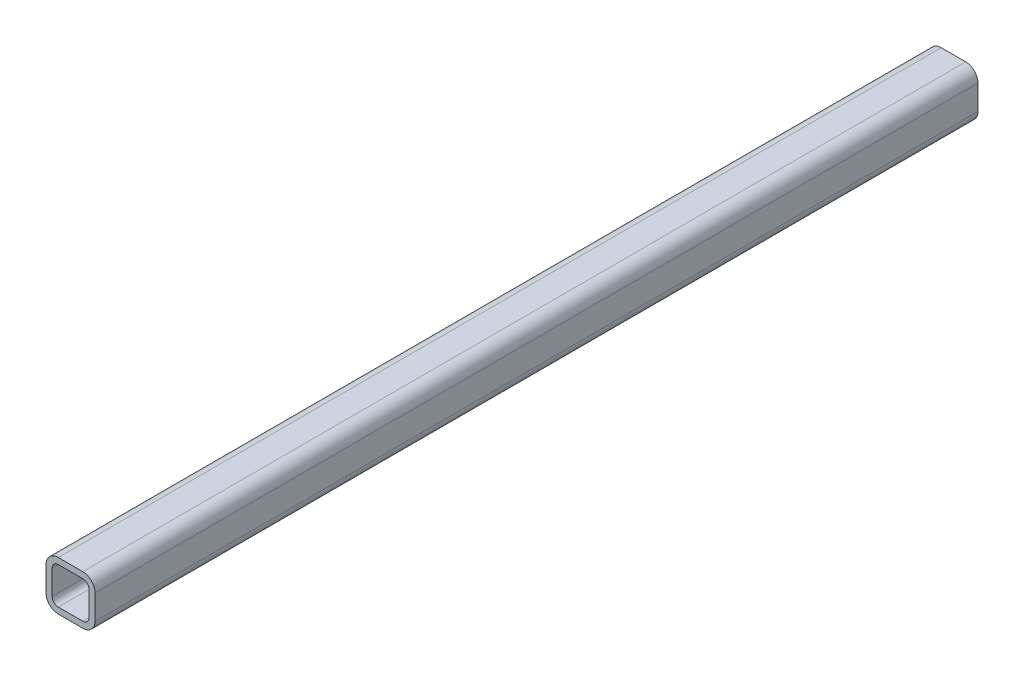
ISO-10303-21;
HEADER;
FILE_DESCRIPTION(('STEP AP214'),'2;1');
FILE_NAME('part.step','',(''),(''),'','','');
FILE_SCHEMA(('AUTOMOTIVE_DESIGN { 1 0 10303 214 1 1 1 1 }'));
ENDSEC;
DATA;
#1=APPLICATION_CONTEXT('core data for automotive mechanical design processes');
#2=APPLICATION_PROTOCOL_DEFINITION('international standard','automotive_design',2000,#1);
#3=PRODUCT_CONTEXT('',#1,'mechanical');
#4=PRODUCT('Part','Part','',(#3));
#5=PRODUCT_RELATED_PRODUCT_CATEGORY('part','',(#4));
#6=PRODUCT_DEFINITION_FORMATION('','',#4);
#7=PRODUCT_DEFINITION_CONTEXT('part definition',#1,'design');
#8=PRODUCT_DEFINITION('design','',#6,#7);
#9=PRODUCT_DEFINITION_SHAPE('','',#8);
#10=(LENGTH_UNIT() NAMED_UNIT(*) SI_UNIT(.MILLI.,.METRE.));
#11=(NAMED_UNIT(*) PLANE_ANGLE_UNIT() SI_UNIT($,.RADIAN.));
#12=(NAMED_UNIT(*) SI_UNIT($,.STERADIAN.) SOLID_ANGLE_UNIT());
#13=UNCERTAINTY_MEASURE_WITH_UNIT(LENGTH_MEASURE(1.E-05),#10,'distance_accuracy_value','');
#14=(GEOMETRIC_REPRESENTATION_CONTEXT(3) GLOBAL_UNCERTAINTY_ASSIGNED_CONTEXT((#13)) GLOBAL_UNIT_ASSIGNED_CONTEXT((#10,
#11,#12)) REPRESENTATION_CONTEXT('',''));
#15=CARTESIAN_POINT('',(0.,0.,0.));
#16=DIRECTION('',(0.,0.,1.));
#17=DIRECTION('',(1.,0.,0.));
#18=AXIS2_PLACEMENT_3D('',#15,#16,#17);
#19=CARTESIAN_POINT('',(38.1,38.1,457.2));
#20=DIRECTION('',(0.,0.,1.));
#21=DIRECTION('',(1.,0.,0.));
#22=AXIS2_PLACEMENT_3D('',#19,#20,#21);
#23=PLANE('',#22);
#24=CARTESIAN_POINT('',(38.1,38.1,457.2));
#25=DIRECTION('',(0.,0.,1.));
#26=DIRECTION('',(1.,0.,0.));
#27=AXIS2_PLACEMENT_3D('',#24,#25,#26);
#28=CIRCLE('',#27,12.7);
#29=CARTESIAN_POINT('',(50.8,38.1,457.2));
#30=VERTEX_POINT('',#29);
#31=CARTESIAN_POINT('',(38.1,50.8,457.2));
#32=VERTEX_POINT('',#31);
#33=EDGE_CURVE('E213',#30,#32,#28,.T.);
#34=ORIENTED_EDGE('',*,*,#33,.T.);
#35=DIRECTION('',(-1.,0.,0.));
#36=VECTOR('',#35,1.);
#37=CARTESIAN_POINT('',(38.1,50.8,457.2));
#38=LINE('',#37,#36);
#39=CARTESIAN_POINT('',(12.7,50.8,457.2));
#40=VERTEX_POINT('',#39);
#41=EDGE_CURVE('E216',#32,#40,#38,.T.);
#42=ORIENTED_EDGE('',*,*,#41,.T.);
#43=CARTESIAN_POINT('',(12.7,38.1,457.2));
#44=DIRECTION('',(0.,0.,1.));
#45=DIRECTION('',(1.,0.,0.));
#46=AXIS2_PLACEMENT_3D('',#43,#44,#45);
#47=CIRCLE('',#46,12.7);
#48=CARTESIAN_POINT('',(0.,38.1,457.2));
#49=VERTEX_POINT('',#48);
#50=EDGE_CURVE('E219',#40,#49,#47,.T.);
#51=ORIENTED_EDGE('',*,*,#50,.T.);
#52=DIRECTION('',(0.,-1.,0.));
#53=VECTOR('',#52,1.);
#54=CARTESIAN_POINT('',(0.,12.7,457.2));
#55=LINE('',#54,#53);
#56=CARTESIAN_POINT('',(0.,12.7,457.2));
#57=VERTEX_POINT('',#56);
#58=EDGE_CURVE('E221',#49,#57,#55,.T.);
#59=ORIENTED_EDGE('',*,*,#58,.T.);
#60=CARTESIAN_POINT('',(12.7,12.7,457.2));
#61=DIRECTION('',(0.,0.,1.));
#62=DIRECTION('',(1.,0.,0.));
#63=AXIS2_PLACEMENT_3D('',#60,#61,#62);
#64=CIRCLE('',#63,12.7);
#65=CARTESIAN_POINT('',(12.7,0.,457.2));
#66=VERTEX_POINT('',#65);
#67=EDGE_CURVE('E223',#57,#66,#64,.T.);
#68=ORIENTED_EDGE('',*,*,#67,.T.);
#69=DIRECTION('',(1.,0.,0.));
#70=VECTOR('',#69,1.);
#71=CARTESIAN_POINT('',(12.7,0.,457.2));
#72=LINE('',#71,#70);
#73=CARTESIAN_POINT('',(38.1,0.,457.2));
#74=VERTEX_POINT('',#73);
#75=EDGE_CURVE('E225',#66,#74,#72,.T.);
#76=ORIENTED_EDGE('',*,*,#75,.T.);
#77=CARTESIAN_POINT('',(38.1,12.7,457.2));
#78=DIRECTION('',(0.,0.,1.));
#79=DIRECTION('',(1.,0.,0.));
#80=AXIS2_PLACEMENT_3D('',#77,#78,#79);
#81=CIRCLE('',#80,12.7);
#82=CARTESIAN_POINT('',(50.8,12.7,457.2));
#83=VERTEX_POINT('',#82);
#84=EDGE_CURVE('E227',#74,#83,#81,.T.);
#85=ORIENTED_EDGE('',*,*,#84,.T.);
#86=DIRECTION('',(0.,1.,0.));
#87=VECTOR('',#86,1.);
#88=CARTESIAN_POINT('',(50.8,38.1,457.2));
#89=LINE('',#88,#87);
#90=EDGE_CURVE('E229',#83,#30,#89,.T.);
#91=ORIENTED_EDGE('',*,*,#90,.T.);
#92=EDGE_LOOP('',(#34,#42,#51,#59,#68,#76,#85,#91));
#93=FACE_BOUND('',#92,.T.);
#94=DIRECTION('',(0.,-1.,0.));
#95=VECTOR('',#94,1.);
#96=CARTESIAN_POINT('',(6.35,12.7,457.2));
#97=LINE('',#96,#95);
#98=CARTESIAN_POINT('',(6.35,38.1,457.2));
#99=VERTEX_POINT('',#98);
#100=CARTESIAN_POINT('',(6.35,12.7,457.2));
#101=VERTEX_POINT('',#100);
#102=EDGE_CURVE('E156',#99,#101,#97,.T.);
#103=ORIENTED_EDGE('',*,*,#102,.F.);
#104=CARTESIAN_POINT('',(12.7,38.1,457.2));
#105=DIRECTION('',(0.,0.,1.));
#106=DIRECTION('',(1.,0.,0.));
#107=AXIS2_PLACEMENT_3D('',#104,#105,#106);
#108=CIRCLE('',#107,6.35);
#109=CARTESIAN_POINT('',(12.7,44.45,457.2));
#110=VERTEX_POINT('',#109);
#111=EDGE_CURVE('E148',#110,#99,#108,.T.);
#112=ORIENTED_EDGE('',*,*,#111,.F.);
#113=DIRECTION('',(-1.,0.,0.));
#114=VECTOR('',#113,1.);
#115=CARTESIAN_POINT('',(38.1,44.45,457.2));
#116=LINE('',#115,#114);
#117=CARTESIAN_POINT('',(38.1,44.45,457.2));
#118=VERTEX_POINT('',#117);
#119=EDGE_CURVE('E181',#118,#110,#116,.T.);
#120=ORIENTED_EDGE('',*,*,#119,.F.);
#121=CARTESIAN_POINT('',(38.1,38.1,457.2));
#122=DIRECTION('',(0.,0.,1.));
#123=DIRECTION('',(1.,0.,0.));
#124=AXIS2_PLACEMENT_3D('',#121,#122,#123);
#125=CIRCLE('',#124,6.35);
#126=CARTESIAN_POINT('',(44.45,38.1,457.2));
#127=VERTEX_POINT('',#126);
#128=EDGE_CURVE('E179',#127,#118,#125,.T.);
#129=ORIENTED_EDGE('',*,*,#128,.F.);
#130=DIRECTION('',(0.,1.,0.));
#131=VECTOR('',#130,1.);
#132=CARTESIAN_POINT('',(44.45,38.1,457.2));
#133=LINE('',#132,#131);
#134=CARTESIAN_POINT('',(44.45,12.7,457.2));
#135=VERTEX_POINT('',#134);
#136=EDGE_CURVE('E177',#135,#127,#133,.T.);
#137=ORIENTED_EDGE('',*,*,#136,.F.);
#138=CARTESIAN_POINT('',(38.1,12.7,457.2));
#139=DIRECTION('',(0.,0.,1.));
#140=DIRECTION('',(1.,0.,0.));
#141=AXIS2_PLACEMENT_3D('',#138,#139,#140);
#142=CIRCLE('',#141,6.35);
#143=CARTESIAN_POINT('',(38.1,6.35,457.2));
#144=VERTEX_POINT('',#143);
#145=EDGE_CURVE('E175',#144,#135,#142,.T.);
#146=ORIENTED_EDGE('',*,*,#145,.F.);
#147=DIRECTION('',(1.,0.,0.));
#148=VECTOR('',#147,1.);
#149=CARTESIAN_POINT('',(12.7,6.34999999999999,457.2));
#150=LINE('',#149,#148);
#151=CARTESIAN_POINT('',(12.7,6.34999999999999,457.2));
#152=VERTEX_POINT('',#151);
#153=EDGE_CURVE('E171',#152,#144,#150,.T.);
#154=ORIENTED_EDGE('',*,*,#153,.F.);
#155=CARTESIAN_POINT('',(12.7,12.7,457.2));
#156=DIRECTION('',(0.,0.,1.));
#157=DIRECTION('',(1.,0.,0.));
#158=AXIS2_PLACEMENT_3D('',#155,#156,#157);
#159=CIRCLE('',#158,6.35);
#160=EDGE_CURVE('E169',#101,#152,#159,.T.);
#161=ORIENTED_EDGE('',*,*,#160,.F.);
#162=EDGE_LOOP('',(#103,#112,#120,#129,#137,#146,#154,#161));
#163=FACE_BOUND('',#162,.T.);
#164=ADVANCED_FACE('F35',(#93,#163),#23,.T.);
#165=CARTESIAN_POINT('',(38.1,38.1,-457.2));
#166=DIRECTION('',(0.,0.,1.));
#167=DIRECTION('',(1.,0.,0.));
#168=AXIS2_PLACEMENT_3D('',#165,#166,#167);
#169=PLANE('',#168);
#170=CARTESIAN_POINT('',(38.1,38.1,-457.2));
#171=DIRECTION('',(0.,0.,1.));
#172=DIRECTION('',(1.,0.,0.));
#173=AXIS2_PLACEMENT_3D('',#170,#171,#172);
#174=CIRCLE('',#173,12.7);
#175=CARTESIAN_POINT('',(50.8,38.1,-457.2));
#176=VERTEX_POINT('',#175);
#177=CARTESIAN_POINT('',(38.1,50.8,-457.2));
#178=VERTEX_POINT('',#177);
#179=EDGE_CURVE('E164',#176,#178,#174,.T.);
#180=ORIENTED_EDGE('',*,*,#179,.F.);
#181=DIRECTION('',(0.,1.,0.));
#182=VECTOR('',#181,1.);
#183=CARTESIAN_POINT('',(50.8,38.1,-457.2));
#184=LINE('',#183,#182);
#185=CARTESIAN_POINT('',(50.8,12.7,-457.2));
#186=VERTEX_POINT('',#185);
#187=EDGE_CURVE('E217',#186,#176,#184,.T.);
#188=ORIENTED_EDGE('',*,*,#187,.F.);
#189=CARTESIAN_POINT('',(38.1,12.7,-457.2));
#190=DIRECTION('',(0.,0.,1.));
#191=DIRECTION('',(1.,0.,0.));
#192=AXIS2_PLACEMENT_3D('',#189,#190,#191);
#193=CIRCLE('',#192,12.7);
#194=CARTESIAN_POINT('',(38.1,0.,-457.2));
#195=VERTEX_POINT('',#194);
#196=EDGE_CURVE('E244',#195,#186,#193,.T.);
#197=ORIENTED_EDGE('',*,*,#196,.F.);
#198=DIRECTION('',(1.,0.,0.));
#199=VECTOR('',#198,1.);
#200=CARTESIAN_POINT('',(12.7,0.,-457.2));
#201=LINE('',#200,#199);
#202=CARTESIAN_POINT('',(12.7,0.,-457.2));
#203=VERTEX_POINT('',#202);
#204=EDGE_CURVE('E242',#203,#195,#201,.T.);
#205=ORIENTED_EDGE('',*,*,#204,.F.);
#206=CARTESIAN_POINT('',(12.7,12.7,-457.2));
#207=DIRECTION('',(0.,0.,1.));
#208=DIRECTION('',(1.,0.,0.));
#209=AXIS2_PLACEMENT_3D('',#206,#207,#208);
#210=CIRCLE('',#209,12.7);
#211=CARTESIAN_POINT('',(0.,12.7,-457.2));
#212=VERTEX_POINT('',#211);
#213=EDGE_CURVE('E240',#212,#203,#210,.T.);
#214=ORIENTED_EDGE('',*,*,#213,.F.);
#215=DIRECTION('',(0.,-1.,0.));
#216=VECTOR('',#215,1.);
#217=CARTESIAN_POINT('',(0.,12.7,-457.2));
#218=LINE('',#217,#216);
#219=CARTESIAN_POINT('',(0.,38.1,-457.2));
#220=VERTEX_POINT('',#219);
#221=EDGE_CURVE('E238',#220,#212,#218,.T.);
#222=ORIENTED_EDGE('',*,*,#221,.F.);
#223=CARTESIAN_POINT('',(12.7,38.1,-457.2));
#224=DIRECTION('',(0.,0.,1.));
#225=DIRECTION('',(1.,0.,0.));
#226=AXIS2_PLACEMENT_3D('',#223,#224,#225);
#227=CIRCLE('',#226,12.7);
#228=CARTESIAN_POINT('',(12.7,50.8,-457.2));
#229=VERTEX_POINT('',#228);
#230=EDGE_CURVE('E236',#229,#220,#227,.T.);
#231=ORIENTED_EDGE('',*,*,#230,.F.);
#232=DIRECTION('',(-1.,0.,0.));
#233=VECTOR('',#232,1.);
#234=CARTESIAN_POINT('',(38.1,50.8,-457.2));
#235=LINE('',#234,#233);
#236=EDGE_CURVE('E234',#178,#229,#235,.T.);
#237=ORIENTED_EDGE('',*,*,#236,.F.);
#238=EDGE_LOOP('',(#180,#188,#197,#205,#214,#222,#231,#237));
#239=FACE_BOUND('',#238,.T.);
#240=CARTESIAN_POINT('',(12.7,38.1,-457.2));
#241=DIRECTION('',(0.,0.,1.));
#242=DIRECTION('',(1.,0.,0.));
#243=AXIS2_PLACEMENT_3D('',#240,#241,#242);
#244=CIRCLE('',#243,6.35);
#245=CARTESIAN_POINT('',(12.7,44.45,-457.2));
#246=VERTEX_POINT('',#245);
#247=CARTESIAN_POINT('',(6.35,38.1,-457.2));
#248=VERTEX_POINT('',#247);
#249=EDGE_CURVE('E58',#246,#248,#244,.T.);
#250=ORIENTED_EDGE('',*,*,#249,.T.);
#251=DIRECTION('',(0.,-1.,0.));
#252=VECTOR('',#251,1.);
#253=CARTESIAN_POINT('',(6.35,12.7,-457.2));
#254=LINE('',#253,#252);
#255=CARTESIAN_POINT('',(6.35,12.7,-457.2));
#256=VERTEX_POINT('',#255);
#257=EDGE_CURVE('E163',#248,#256,#254,.T.);
#258=ORIENTED_EDGE('',*,*,#257,.T.);
#259=CARTESIAN_POINT('',(12.7,12.7,-457.2));
#260=DIRECTION('',(0.,0.,1.));
#261=DIRECTION('',(1.,0.,0.));
#262=AXIS2_PLACEMENT_3D('',#259,#260,#261);
#263=CIRCLE('',#262,6.35);
#264=CARTESIAN_POINT('',(12.7,6.34999999999999,-457.2));
#265=VERTEX_POINT('',#264);
#266=EDGE_CURVE('E185',#256,#265,#263,.T.);
#267=ORIENTED_EDGE('',*,*,#266,.T.);
#268=DIRECTION('',(1.,0.,0.));
#269=VECTOR('',#268,1.);
#270=CARTESIAN_POINT('',(12.7,6.34999999999999,-457.2));
#271=LINE('',#270,#269);
#272=CARTESIAN_POINT('',(38.1,6.35,-457.2));
#273=VERTEX_POINT('',#272);
#274=EDGE_CURVE('E188',#265,#273,#271,.T.);
#275=ORIENTED_EDGE('',*,*,#274,.T.);
#276=CARTESIAN_POINT('',(38.1,12.7,-457.2));
#277=DIRECTION('',(0.,0.,1.));
#278=DIRECTION('',(1.,0.,0.));
#279=AXIS2_PLACEMENT_3D('',#276,#277,#278);
#280=CIRCLE('',#279,6.35);
#281=CARTESIAN_POINT('',(44.45,12.7,-457.2));
#282=VERTEX_POINT('',#281);
#283=EDGE_CURVE('E191',#273,#282,#280,.T.);
#284=ORIENTED_EDGE('',*,*,#283,.T.);
#285=DIRECTION('',(0.,1.,0.));
#286=VECTOR('',#285,1.);
#287=CARTESIAN_POINT('',(44.45,38.1,-457.2));
#288=LINE('',#287,#286);
#289=CARTESIAN_POINT('',(44.45,38.1,-457.2));
#290=VERTEX_POINT('',#289);
#291=EDGE_CURVE('E194',#282,#290,#288,.T.);
#292=ORIENTED_EDGE('',*,*,#291,.T.);
#293=CARTESIAN_POINT('',(38.1,38.1,-457.2));
#294=DIRECTION('',(0.,0.,1.));
#295=DIRECTION('',(1.,0.,0.));
#296=AXIS2_PLACEMENT_3D('',#293,#294,#295);
#297=CIRCLE('',#296,6.35);
#298=CARTESIAN_POINT('',(38.1,44.45,-457.2));
#299=VERTEX_POINT('',#298);
#300=EDGE_CURVE('E197',#290,#299,#297,.T.);
#301=ORIENTED_EDGE('',*,*,#300,.T.);
#302=DIRECTION('',(-1.,0.,0.));
#303=VECTOR('',#302,1.);
#304=CARTESIAN_POINT('',(38.1,44.45,-457.2));
#305=LINE('',#304,#303);
#306=EDGE_CURVE('E157',#299,#246,#305,.T.);
#307=ORIENTED_EDGE('',*,*,#306,.T.);
#308=EDGE_LOOP('',(#250,#258,#267,#275,#284,#292,#301,#307));
#309=FACE_BOUND('',#308,.T.);
#310=ADVANCED_FACE('F274',(#239,#309),#169,.F.);
#311=CARTESIAN_POINT('',(38.1,38.1,457.2));
#312=DIRECTION('',(0.,0.,-1.));
#313=DIRECTION('',(-1.,0.,0.));
#314=AXIS2_PLACEMENT_3D('',#311,#312,#313);
#315=CYLINDRICAL_SURFACE('',#314,12.7);
#316=ORIENTED_EDGE('',*,*,#179,.T.);
#317=DIRECTION('',(0.,0.,-1.));
#318=VECTOR('',#317,1.);
#319=CARTESIAN_POINT('',(38.1,50.8,457.2));
#320=LINE('',#319,#318);
#321=EDGE_CURVE('E11',#32,#178,#320,.T.);
#322=ORIENTED_EDGE('',*,*,#321,.F.);
#323=ORIENTED_EDGE('',*,*,#33,.F.);
#324=DIRECTION('',(0.,0.,-1.));
#325=VECTOR('',#324,1.);
#326=CARTESIAN_POINT('',(50.8,38.1,457.2));
#327=LINE('',#326,#325);
#328=EDGE_CURVE('E231',#30,#176,#327,.T.);
#329=ORIENTED_EDGE('',*,*,#328,.T.);
#330=EDGE_LOOP('',(#316,#322,#323,#329));
#331=FACE_BOUND('',#330,.T.);
#332=ADVANCED_FACE('F37',(#331),#315,.T.);
#333=CARTESIAN_POINT('',(38.1,50.8,457.2));
#334=DIRECTION('',(0.,-1.,0.));
#335=DIRECTION('',(1.,0.,0.));
#336=AXIS2_PLACEMENT_3D('',#333,#334,#335);
#337=PLANE('',#336);
#338=ORIENTED_EDGE('',*,*,#236,.T.);
#339=DIRECTION('',(0.,0.,-1.));
#340=VECTOR('',#339,1.);
#341=CARTESIAN_POINT('',(12.7,50.8,457.2));
#342=LINE('',#341,#340);
#343=EDGE_CURVE('E43',#40,#229,#342,.T.);
#344=ORIENTED_EDGE('',*,*,#343,.F.);
#345=ORIENTED_EDGE('',*,*,#41,.F.);
#346=ORIENTED_EDGE('',*,*,#321,.T.);
#347=EDGE_LOOP('',(#338,#344,#345,#346));
#348=FACE_BOUND('',#347,.T.);
#349=ADVANCED_FACE('F291',(#348),#337,.F.);
#350=CARTESIAN_POINT('',(12.7,38.1,457.2));
#351=DIRECTION('',(0.,0.,-1.));
#352=DIRECTION('',(-1.,0.,0.));
#353=AXIS2_PLACEMENT_3D('',#350,#351,#352);
#354=CYLINDRICAL_SURFACE('',#353,12.7);
#355=ORIENTED_EDGE('',*,*,#230,.T.);
#356=DIRECTION('',(0.,0.,-1.));
#357=VECTOR('',#356,1.);
#358=CARTESIAN_POINT('',(0.,38.1,457.2));
#359=LINE('',#358,#357);
#360=EDGE_CURVE('E261',#49,#220,#359,.T.);
#361=ORIENTED_EDGE('',*,*,#360,.F.);
#362=ORIENTED_EDGE('',*,*,#50,.F.);
#363=ORIENTED_EDGE('',*,*,#343,.T.);
#364=EDGE_LOOP('',(#355,#361,#362,#363));
#365=FACE_BOUND('',#364,.T.);
#366=ADVANCED_FACE('F268',(#365),#354,.T.);
#367=CARTESIAN_POINT('',(0.,12.7,457.2));
#368=DIRECTION('',(1.,0.,0.));
#369=DIRECTION('',(0.,1.,0.));
#370=AXIS2_PLACEMENT_3D('',#367,#368,#369);
#371=PLANE('',#370);
#372=ORIENTED_EDGE('',*,*,#221,.T.);
#373=DIRECTION('',(0.,0.,-1.));
#374=VECTOR('',#373,1.);
#375=CARTESIAN_POINT('',(0.,12.7,457.2));
#376=LINE('',#375,#374);
#377=EDGE_CURVE('E258',#57,#212,#376,.T.);
#378=ORIENTED_EDGE('',*,*,#377,.F.);
#379=ORIENTED_EDGE('',*,*,#58,.F.);
#380=ORIENTED_EDGE('',*,*,#360,.T.);
#381=EDGE_LOOP('',(#372,#378,#379,#380));
#382=FACE_BOUND('',#381,.T.);
#383=ADVANCED_FACE('F280',(#382),#371,.F.);
#384=CARTESIAN_POINT('',(12.7,12.7,457.2));
#385=DIRECTION('',(0.,0.,-1.));
#386=DIRECTION('',(-1.,0.,0.));
#387=AXIS2_PLACEMENT_3D('',#384,#385,#386);
#388=CYLINDRICAL_SURFACE('',#387,12.7);
#389=ORIENTED_EDGE('',*,*,#213,.T.);
#390=DIRECTION('',(0.,0.,-1.));
#391=VECTOR('',#390,1.);
#392=CARTESIAN_POINT('',(12.7,0.,457.2));
#393=LINE('',#392,#391);
#394=EDGE_CURVE('E255',#66,#203,#393,.T.);
#395=ORIENTED_EDGE('',*,*,#394,.F.);
#396=ORIENTED_EDGE('',*,*,#67,.F.);
#397=ORIENTED_EDGE('',*,*,#377,.T.);
#398=EDGE_LOOP('',(#389,#395,#396,#397));
#399=FACE_BOUND('',#398,.T.);
#400=ADVANCED_FACE('F284',(#399),#388,.T.);
#401=CARTESIAN_POINT('',(12.7,0.,457.2));
#402=DIRECTION('',(0.,1.,0.));
#403=DIRECTION('',(-1.,0.,0.));
#404=AXIS2_PLACEMENT_3D('',#401,#402,#403);
#405=PLANE('',#404);
#406=ORIENTED_EDGE('',*,*,#204,.T.);
#407=DIRECTION('',(0.,0.,-1.));
#408=VECTOR('',#407,1.);
#409=CARTESIAN_POINT('',(38.1,0.,457.2));
#410=LINE('',#409,#408);
#411=EDGE_CURVE('E252',#74,#195,#410,.T.);
#412=ORIENTED_EDGE('',*,*,#411,.F.);
#413=ORIENTED_EDGE('',*,*,#75,.F.);
#414=ORIENTED_EDGE('',*,*,#394,.T.);
#415=EDGE_LOOP('',(#406,#412,#413,#414));
#416=FACE_BOUND('',#415,.T.);
#417=ADVANCED_FACE('F304',(#416),#405,.F.);
#418=CARTESIAN_POINT('',(38.1,12.7,457.2));
#419=DIRECTION('',(0.,0.,-1.));
#420=DIRECTION('',(-1.,0.,0.));
#421=AXIS2_PLACEMENT_3D('',#418,#419,#420);
#422=CYLINDRICAL_SURFACE('',#421,12.7);
#423=ORIENTED_EDGE('',*,*,#196,.T.);
#424=DIRECTION('',(0.,0.,-1.));
#425=VECTOR('',#424,1.);
#426=CARTESIAN_POINT('',(50.8,12.7,457.2));
#427=LINE('',#426,#425);
#428=EDGE_CURVE('E249',#83,#186,#427,.T.);
#429=ORIENTED_EDGE('',*,*,#428,.F.);
#430=ORIENTED_EDGE('',*,*,#84,.F.);
#431=ORIENTED_EDGE('',*,*,#411,.T.);
#432=EDGE_LOOP('',(#423,#429,#430,#431));
#433=FACE_BOUND('',#432,.T.);
#434=ADVANCED_FACE('F302',(#433),#422,.T.);
#435=CARTESIAN_POINT('',(50.8,38.1,457.2));
#436=DIRECTION('',(-1.,0.,0.));
#437=DIRECTION('',(0.,-1.,0.));
#438=AXIS2_PLACEMENT_3D('',#435,#436,#437);
#439=PLANE('',#438);
#440=ORIENTED_EDGE('',*,*,#187,.T.);
#441=ORIENTED_EDGE('',*,*,#328,.F.);
#442=ORIENTED_EDGE('',*,*,#90,.F.);
#443=ORIENTED_EDGE('',*,*,#428,.T.);
#444=EDGE_LOOP('',(#440,#441,#442,#443));
#445=FACE_BOUND('',#444,.T.);
#446=ADVANCED_FACE('F297',(#445),#439,.F.);
#447=CARTESIAN_POINT('',(12.7,38.1,457.2));
#448=DIRECTION('',(0.,0.,-1.));
#449=DIRECTION('',(-1.,0.,0.));
#450=AXIS2_PLACEMENT_3D('',#447,#448,#449);
#451=CYLINDRICAL_SURFACE('',#450,6.35);
#452=ORIENTED_EDGE('',*,*,#249,.F.);
#453=DIRECTION('',(0.,0.,-1.));
#454=VECTOR('',#453,1.);
#455=CARTESIAN_POINT('',(12.7,44.45,457.2));
#456=LINE('',#455,#454);
#457=EDGE_CURVE('E152',#110,#246,#456,.T.);
#458=ORIENTED_EDGE('',*,*,#457,.F.);
#459=ORIENTED_EDGE('',*,*,#111,.T.);
#460=DIRECTION('',(0.,0.,-1.));
#461=VECTOR('',#460,1.);
#462=CARTESIAN_POINT('',(6.35,38.1,457.2));
#463=LINE('',#462,#461);
#464=EDGE_CURVE('E151',#99,#248,#463,.T.);
#465=ORIENTED_EDGE('',*,*,#464,.T.);
#466=EDGE_LOOP('',(#452,#458,#459,#465));
#467=FACE_BOUND('',#466,.T.);
#468=ADVANCED_FACE('F150',(#467),#451,.F.);
#469=CARTESIAN_POINT('',(6.35,12.7,457.2));
#470=DIRECTION('',(1.,0.,0.));
#471=DIRECTION('',(0.,1.,0.));
#472=AXIS2_PLACEMENT_3D('',#469,#470,#471);
#473=PLANE('',#472);
#474=ORIENTED_EDGE('',*,*,#257,.F.);
#475=ORIENTED_EDGE('',*,*,#464,.F.);
#476=ORIENTED_EDGE('',*,*,#102,.T.);
#477=DIRECTION('',(0.,0.,-1.));
#478=VECTOR('',#477,1.);
#479=CARTESIAN_POINT('',(6.35,12.7,457.2));
#480=LINE('',#479,#478);
#481=EDGE_CURVE('E165',#101,#256,#480,.T.);
#482=ORIENTED_EDGE('',*,*,#481,.T.);
#483=EDGE_LOOP('',(#474,#475,#476,#482));
#484=FACE_BOUND('',#483,.T.);
#485=ADVANCED_FACE('F160',(#484),#473,.T.);
#486=CARTESIAN_POINT('',(12.7,12.7,457.2));
#487=DIRECTION('',(0.,0.,-1.));
#488=DIRECTION('',(-1.,0.,0.));
#489=AXIS2_PLACEMENT_3D('',#486,#487,#488);
#490=CYLINDRICAL_SURFACE('',#489,6.35);
#491=ORIENTED_EDGE('',*,*,#266,.F.);
#492=ORIENTED_EDGE('',*,*,#481,.F.);
#493=ORIENTED_EDGE('',*,*,#160,.T.);
#494=DIRECTION('',(0.,0.,-1.));
#495=VECTOR('',#494,1.);
#496=CARTESIAN_POINT('',(12.7,6.34999999999999,457.2));
#497=LINE('',#496,#495);
#498=EDGE_CURVE('E210',#152,#265,#497,.T.);
#499=ORIENTED_EDGE('',*,*,#498,.T.);
#500=EDGE_LOOP('',(#491,#492,#493,#499));
#501=FACE_BOUND('',#500,.T.);
#502=ADVANCED_FACE('F329',(#501),#490,.F.);
#503=CARTESIAN_POINT('',(12.7,6.34999999999999,457.2));
#504=DIRECTION('',(0.,1.,0.));
#505=DIRECTION('',(-1.,0.,0.));
#506=AXIS2_PLACEMENT_3D('',#503,#504,#505);
#507=PLANE('',#506);
#508=ORIENTED_EDGE('',*,*,#274,.F.);
#509=ORIENTED_EDGE('',*,*,#498,.F.);
#510=ORIENTED_EDGE('',*,*,#153,.T.);
#511=DIRECTION('',(0.,0.,-1.));
#512=VECTOR('',#511,1.);
#513=CARTESIAN_POINT('',(38.1,6.35,457.2));
#514=LINE('',#513,#512);
#515=EDGE_CURVE('E208',#144,#273,#514,.T.);
#516=ORIENTED_EDGE('',*,*,#515,.T.);
#517=EDGE_LOOP('',(#508,#509,#510,#516));
#518=FACE_BOUND('',#517,.T.);
#519=ADVANCED_FACE('F333',(#518),#507,.T.);
#520=CARTESIAN_POINT('',(38.1,12.7,457.2));
#521=DIRECTION('',(0.,0.,-1.));
#522=DIRECTION('',(-1.,0.,0.));
#523=AXIS2_PLACEMENT_3D('',#520,#521,#522);
#524=CYLINDRICAL_SURFACE('',#523,6.35);
#525=ORIENTED_EDGE('',*,*,#283,.F.);
#526=ORIENTED_EDGE('',*,*,#515,.F.);
#527=ORIENTED_EDGE('',*,*,#145,.T.);
#528=DIRECTION('',(0.,0.,-1.));
#529=VECTOR('',#528,1.);
#530=CARTESIAN_POINT('',(44.45,12.7,457.2));
#531=LINE('',#530,#529);
#532=EDGE_CURVE('E206',#135,#282,#531,.T.);
#533=ORIENTED_EDGE('',*,*,#532,.T.);
#534=EDGE_LOOP('',(#525,#526,#527,#533));
#535=FACE_BOUND('',#534,.T.);
#536=ADVANCED_FACE('F339',(#535),#524,.F.);
#537=CARTESIAN_POINT('',(44.45,38.1,457.2));
#538=DIRECTION('',(-1.,0.,0.));
#539=DIRECTION('',(0.,-1.,0.));
#540=AXIS2_PLACEMENT_3D('',#537,#538,#539);
#541=PLANE('',#540);
#542=ORIENTED_EDGE('',*,*,#291,.F.);
#543=ORIENTED_EDGE('',*,*,#532,.F.);
#544=ORIENTED_EDGE('',*,*,#136,.T.);
#545=DIRECTION('',(0.,0.,-1.));
#546=VECTOR('',#545,1.);
#547=CARTESIAN_POINT('',(44.45,38.1,457.2));
#548=LINE('',#547,#546);
#549=EDGE_CURVE('E204',#127,#290,#548,.T.);
#550=ORIENTED_EDGE('',*,*,#549,.T.);
#551=EDGE_LOOP('',(#542,#543,#544,#550));
#552=FACE_BOUND('',#551,.T.);
#553=ADVANCED_FACE('F343',(#552),#541,.T.);
#554=CARTESIAN_POINT('',(38.1,38.1,457.2));
#555=DIRECTION('',(0.,0.,-1.));
#556=DIRECTION('',(-1.,0.,0.));
#557=AXIS2_PLACEMENT_3D('',#554,#555,#556);
#558=CYLINDRICAL_SURFACE('',#557,6.35);
#559=ORIENTED_EDGE('',*,*,#300,.F.);
#560=ORIENTED_EDGE('',*,*,#549,.F.);
#561=ORIENTED_EDGE('',*,*,#128,.T.);
#562=DIRECTION('',(0.,0.,-1.));
#563=VECTOR('',#562,1.);
#564=CARTESIAN_POINT('',(38.1,44.45,457.2));
#565=LINE('',#564,#563);
#566=EDGE_CURVE('E50',#118,#299,#565,.T.);
#567=ORIENTED_EDGE('',*,*,#566,.T.);
#568=EDGE_LOOP('',(#559,#560,#561,#567));
#569=FACE_BOUND('',#568,.T.);
#570=ADVANCED_FACE('F347',(#569),#558,.F.);
#571=CARTESIAN_POINT('',(38.1,44.45,457.2));
#572=DIRECTION('',(0.,-1.,0.));
#573=DIRECTION('',(1.,0.,0.));
#574=AXIS2_PLACEMENT_3D('',#571,#572,#573);
#575=PLANE('',#574);
#576=ORIENTED_EDGE('',*,*,#306,.F.);
#577=ORIENTED_EDGE('',*,*,#566,.F.);
#578=ORIENTED_EDGE('',*,*,#119,.T.);
#579=ORIENTED_EDGE('',*,*,#457,.T.);
#580=EDGE_LOOP('',(#576,#577,#578,#579));
#581=FACE_BOUND('',#580,.T.);
#582=ADVANCED_FACE('F351',(#581),#575,.T.);
#583=CLOSED_SHELL('',(#164,#310,#332,#349,#366,#383,#400,#417,#434,#446,#468,#485,#502,#519,
#536,#553,#570,#582));
#584=MANIFOLD_SOLID_BREP('B2',#583);
#585=ADVANCED_BREP_SHAPE_REPRESENTATION('',(#18,#584),#14);
#586=SHAPE_DEFINITION_REPRESENTATION(#9,#585);
ENDSEC;
END-ISO-10303-21;
